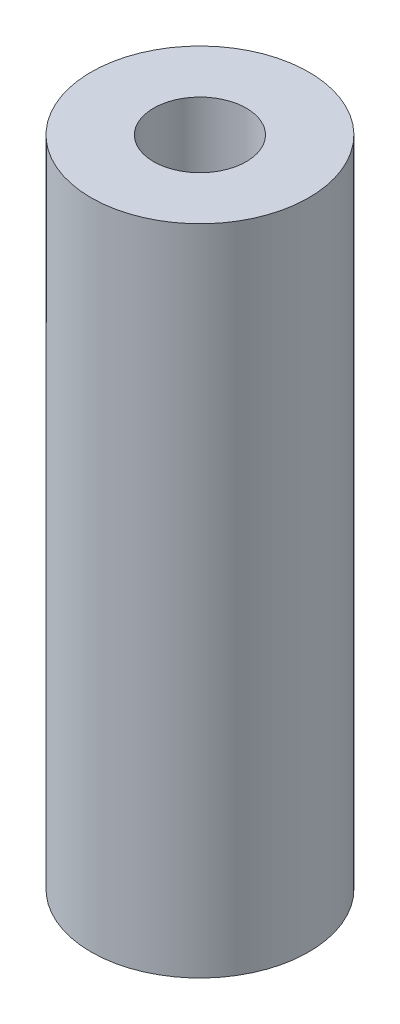
ISO-10303-21;
HEADER;
FILE_DESCRIPTION(('STEP AP214'),'2;1');
FILE_NAME('part.step','',(''),(''),'','','');
FILE_SCHEMA(('AUTOMOTIVE_DESIGN { 1 0 10303 214 1 1 1 1 }'));
ENDSEC;
DATA;
#1=APPLICATION_CONTEXT('core data for automotive mechanical design processes');
#2=APPLICATION_PROTOCOL_DEFINITION('international standard','automotive_design',2000,#1);
#3=PRODUCT_CONTEXT('',#1,'mechanical');
#4=PRODUCT('Part','Part','',(#3));
#5=PRODUCT_RELATED_PRODUCT_CATEGORY('part','',(#4));
#6=PRODUCT_DEFINITION_FORMATION('','',#4);
#7=PRODUCT_DEFINITION_CONTEXT('part definition',#1,'design');
#8=PRODUCT_DEFINITION('design','',#6,#7);
#9=PRODUCT_DEFINITION_SHAPE('','',#8);
#10=(LENGTH_UNIT() NAMED_UNIT(*) SI_UNIT(.MILLI.,.METRE.));
#11=(NAMED_UNIT(*) PLANE_ANGLE_UNIT() SI_UNIT($,.RADIAN.));
#12=(NAMED_UNIT(*) SI_UNIT($,.STERADIAN.) SOLID_ANGLE_UNIT());
#13=UNCERTAINTY_MEASURE_WITH_UNIT(LENGTH_MEASURE(1.E-05),#10,'distance_accuracy_value','');
#14=(GEOMETRIC_REPRESENTATION_CONTEXT(3) GLOBAL_UNCERTAINTY_ASSIGNED_CONTEXT((#13)) GLOBAL_UNIT_ASSIGNED_CONTEXT((#10,
#11,#12)) REPRESENTATION_CONTEXT('',''));
#15=CARTESIAN_POINT('',(0.,0.,0.));
#16=DIRECTION('',(0.,0.,1.));
#17=DIRECTION('',(1.,0.,0.));
#18=AXIS2_PLACEMENT_3D('',#15,#16,#17);
#19=CARTESIAN_POINT('',(0.,19.05,0.));
#20=DIRECTION('',(0.,-1.,0.));
#21=DIRECTION('',(0.,0.,-1.));
#22=AXIS2_PLACEMENT_3D('',#19,#20,#21);
#23=CYLINDRICAL_SURFACE('',#22,3.175);
#24=CARTESIAN_POINT('',(0.,19.05,0.));
#25=DIRECTION('',(0.,1.,0.));
#26=DIRECTION('',(0.,0.,1.));
#27=AXIS2_PLACEMENT_3D('',#24,#25,#26);
#28=CIRCLE('',#27,3.175);
#29=CARTESIAN_POINT('',(0.,19.05,3.175));
#30=VERTEX_POINT('',#29);
#31=EDGE_CURVE('E10',#30,#30,#28,.T.);
#32=ORIENTED_EDGE('',*,*,#31,.F.);
#33=EDGE_LOOP('',(#32));
#34=FACE_BOUND('',#33,.T.);
#35=CARTESIAN_POINT('',(0.,0.,0.));
#36=DIRECTION('',(0.,1.,0.));
#37=DIRECTION('',(0.,0.,1.));
#38=AXIS2_PLACEMENT_3D('',#35,#36,#37);
#39=CIRCLE('',#38,3.175);
#40=CARTESIAN_POINT('',(0.,0.,3.175));
#41=VERTEX_POINT('',#40);
#42=EDGE_CURVE('E34',#41,#41,#39,.T.);
#43=ORIENTED_EDGE('',*,*,#42,.T.);
#44=EDGE_LOOP('',(#43));
#45=FACE_BOUND('',#44,.T.);
#46=ADVANCED_FACE('F31',(#34,#45),#23,.T.);
#47=CARTESIAN_POINT('',(0.,19.05,0.));
#48=DIRECTION('',(0.,1.,0.));
#49=DIRECTION('',(0.,0.,1.));
#50=AXIS2_PLACEMENT_3D('',#47,#48,#49);
#51=PLANE('',#50);
#52=CARTESIAN_POINT('',(0.,19.05,0.));
#53=DIRECTION('',(0.,1.,0.));
#54=DIRECTION('',(0.,0.,1.));
#55=AXIS2_PLACEMENT_3D('',#52,#53,#54);
#56=CIRCLE('',#55,1.35254999999999);
#57=CARTESIAN_POINT('',(0.,19.05,1.35254999999999));
#58=VERTEX_POINT('',#57);
#59=EDGE_CURVE('E45',#58,#58,#56,.T.);
#60=ORIENTED_EDGE('',*,*,#59,.F.);
#61=EDGE_LOOP('',(#60));
#62=FACE_BOUND('',#61,.T.);
#63=ORIENTED_EDGE('',*,*,#31,.T.);
#64=EDGE_LOOP('',(#63));
#65=FACE_BOUND('',#64,.T.);
#66=ADVANCED_FACE('F51',(#62,#65),#51,.T.);
#67=CARTESIAN_POINT('',(0.,0.,0.));
#68=DIRECTION('',(0.,1.,0.));
#69=DIRECTION('',(0.,0.,1.));
#70=AXIS2_PLACEMENT_3D('',#67,#68,#69);
#71=PLANE('',#70);
#72=CARTESIAN_POINT('',(0.,0.,0.));
#73=DIRECTION('',(0.,1.,0.));
#74=DIRECTION('',(0.,0.,1.));
#75=AXIS2_PLACEMENT_3D('',#72,#73,#74);
#76=CIRCLE('',#75,1.35254999999999);
#77=CARTESIAN_POINT('',(0.,0.,1.35254999999999));
#78=VERTEX_POINT('',#77);
#79=EDGE_CURVE('E41',#78,#78,#76,.T.);
#80=ORIENTED_EDGE('',*,*,#79,.T.);
#81=EDGE_LOOP('',(#80));
#82=FACE_BOUND('',#81,.T.);
#83=ORIENTED_EDGE('',*,*,#42,.F.);
#84=EDGE_LOOP('',(#83));
#85=FACE_BOUND('',#84,.T.);
#86=ADVANCED_FACE('F53',(#82,#85),#71,.F.);
#87=CARTESIAN_POINT('',(0.,19.05,0.));
#88=DIRECTION('',(0.,1.,0.));
#89=DIRECTION('',(0.,0.,1.));
#90=AXIS2_PLACEMENT_3D('',#87,#88,#89);
#91=CYLINDRICAL_SURFACE('',#90,1.35254999999999);
#92=ORIENTED_EDGE('',*,*,#79,.F.);
#93=EDGE_LOOP('',(#92));
#94=FACE_BOUND('',#93,.T.);
#95=ORIENTED_EDGE('',*,*,#59,.T.);
#96=EDGE_LOOP('',(#95));
#97=FACE_BOUND('',#96,.T.);
#98=ADVANCED_FACE('F49',(#94,#97),#91,.F.);
#99=CLOSED_SHELL('',(#46,#66,#86,#98));
#100=MANIFOLD_SOLID_BREP('B2',#99);
#101=ADVANCED_BREP_SHAPE_REPRESENTATION('',(#18,#100),#14);
#102=SHAPE_DEFINITION_REPRESENTATION(#9,#101);
ENDSEC;
END-ISO-10303-21;
